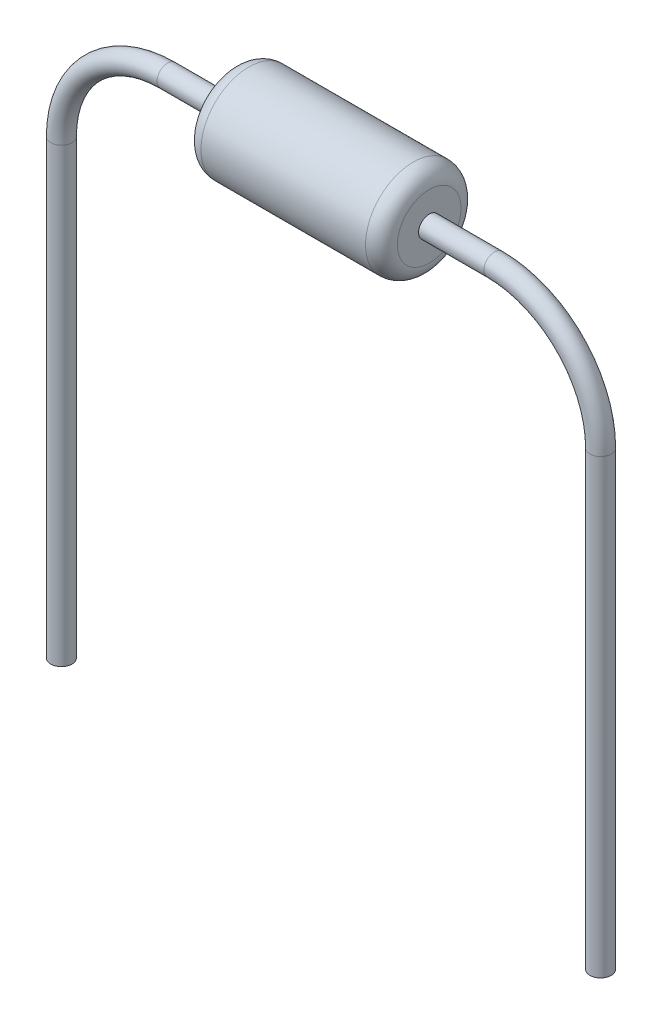
ISO-10303-21;
HEADER;
FILE_DESCRIPTION(('STEP AP214'),'2;1');
FILE_NAME('part.step','',(''),(''),'','','');
FILE_SCHEMA(('AUTOMOTIVE_DESIGN { 1 0 10303 214 1 1 1 1 }'));
ENDSEC;
DATA;
#1=APPLICATION_CONTEXT('core data for automotive mechanical design processes');
#2=APPLICATION_PROTOCOL_DEFINITION('international standard','automotive_design',2000,#1);
#3=PRODUCT_CONTEXT('',#1,'mechanical');
#4=PRODUCT('Part','Part','',(#3));
#5=PRODUCT_RELATED_PRODUCT_CATEGORY('part','',(#4));
#6=PRODUCT_DEFINITION_FORMATION('','',#4);
#7=PRODUCT_DEFINITION_CONTEXT('part definition',#1,'design');
#8=PRODUCT_DEFINITION('design','',#6,#7);
#9=PRODUCT_DEFINITION_SHAPE('','',#8);
#10=(LENGTH_UNIT() NAMED_UNIT(*) SI_UNIT(.MILLI.,.METRE.));
#11=(NAMED_UNIT(*) PLANE_ANGLE_UNIT() SI_UNIT($,.RADIAN.));
#12=(NAMED_UNIT(*) SI_UNIT($,.STERADIAN.) SOLID_ANGLE_UNIT());
#13=UNCERTAINTY_MEASURE_WITH_UNIT(LENGTH_MEASURE(1.E-05),#10,'distance_accuracy_value','');
#14=(GEOMETRIC_REPRESENTATION_CONTEXT(3) GLOBAL_UNCERTAINTY_ASSIGNED_CONTEXT((#13)) GLOBAL_UNIT_ASSIGNED_CONTEXT((#10,
#11,#12)) REPRESENTATION_CONTEXT('',''));
#15=CARTESIAN_POINT('',(0.,0.,0.));
#16=DIRECTION('',(0.,0.,1.));
#17=DIRECTION('',(1.,0.,0.));
#18=AXIS2_PLACEMENT_3D('',#15,#16,#17);
#19=CARTESIAN_POINT('',(-1.55,0.,0.));
#20=DIRECTION('',(1.,0.,0.));
#21=DIRECTION('',(0.,1.,0.));
#22=AXIS2_PLACEMENT_3D('',#19,#20,#21);
#23=TOROIDAL_SURFACE('',#22,0.7,0.1);
#24=CARTESIAN_POINT('',(-1.65,0.,0.));
#25=DIRECTION('',(1.,0.,0.));
#26=DIRECTION('',(0.,1.,0.));
#27=AXIS2_PLACEMENT_3D('',#24,#25,#26);
#28=CIRCLE('',#27,0.699999999999999);
#29=CARTESIAN_POINT('',(-1.65,0.699999999999999,0.));
#30=VERTEX_POINT('',#29);
#31=EDGE_CURVE('E11',#30,#30,#28,.T.);
#32=ORIENTED_EDGE('',*,*,#31,.T.);
#33=EDGE_LOOP('',(#32));
#34=FACE_BOUND('',#33,.T.);
#35=CARTESIAN_POINT('',(-1.55,0.,0.));
#36=DIRECTION('',(1.,0.,0.));
#37=DIRECTION('',(0.,1.,0.));
#38=AXIS2_PLACEMENT_3D('',#35,#36,#37);
#39=CIRCLE('',#38,0.8);
#40=CARTESIAN_POINT('',(-1.55,0.8,0.));
#41=VERTEX_POINT('',#40);
#42=EDGE_CURVE('E68',#41,#41,#39,.T.);
#43=ORIENTED_EDGE('',*,*,#42,.F.);
#44=EDGE_LOOP('',(#43));
#45=FACE_BOUND('',#44,.T.);
#46=ADVANCED_FACE('F46',(#34,#45),#23,.T.);
#47=CARTESIAN_POINT('',(-1.65,0.42,0.));
#48=DIRECTION('',(-1.,0.,0.));
#49=DIRECTION('',(0.,-1.,0.));
#50=AXIS2_PLACEMENT_3D('',#47,#48,#49);
#51=PLANE('',#50);
#52=CARTESIAN_POINT('',(-1.65,0.,0.));
#53=DIRECTION('',(1.,0.,0.));
#54=DIRECTION('',(0.,1.,0.));
#55=AXIS2_PLACEMENT_3D('',#52,#53,#54);
#56=CIRCLE('',#55,0.42);
#57=CARTESIAN_POINT('',(-1.65,0.42,0.));
#58=VERTEX_POINT('',#57);
#59=EDGE_CURVE('E52',#58,#58,#56,.T.);
#60=ORIENTED_EDGE('',*,*,#59,.T.);
#61=EDGE_LOOP('',(#60));
#62=FACE_BOUND('',#61,.T.);
#63=ORIENTED_EDGE('',*,*,#31,.F.);
#64=EDGE_LOOP('',(#63));
#65=FACE_BOUND('',#64,.T.);
#66=ADVANCED_FACE('F76',(#62,#65),#51,.T.);
#67=CARTESIAN_POINT('',(-0.95,0.,0.));
#68=DIRECTION('',(1.,0.,0.));
#69=DIRECTION('',(0.,1.,0.));
#70=AXIS2_PLACEMENT_3D('',#67,#68,#69);
#71=CYLINDRICAL_SURFACE('',#70,0.42);
#72=CARTESIAN_POINT('',(-0.95,0.,0.));
#73=DIRECTION('',(1.,0.,0.));
#74=DIRECTION('',(0.,1.,0.));
#75=AXIS2_PLACEMENT_3D('',#72,#73,#74);
#76=CIRCLE('',#75,0.42);
#77=CARTESIAN_POINT('',(-0.95,0.42,0.));
#78=VERTEX_POINT('',#77);
#79=EDGE_CURVE('E56',#78,#78,#76,.T.);
#80=ORIENTED_EDGE('',*,*,#79,.T.);
#81=EDGE_LOOP('',(#80));
#82=FACE_BOUND('',#81,.T.);
#83=ORIENTED_EDGE('',*,*,#59,.F.);
#84=EDGE_LOOP('',(#83));
#85=FACE_BOUND('',#84,.T.);
#86=ADVANCED_FACE('F80',(#82,#85),#71,.F.);
#87=CARTESIAN_POINT('',(-0.95,0.42,0.));
#88=DIRECTION('',(1.,0.,0.));
#89=DIRECTION('',(0.,1.,0.));
#90=AXIS2_PLACEMENT_3D('',#87,#88,#89);
#91=PLANE('',#90);
#92=CARTESIAN_POINT('',(-0.95,0.,0.));
#93=DIRECTION('',(1.,0.,0.));
#94=DIRECTION('',(0.,1.,0.));
#95=AXIS2_PLACEMENT_3D('',#92,#93,#94);
#96=CIRCLE('',#95,0.75);
#97=CARTESIAN_POINT('',(-0.95,0.75,0.));
#98=VERTEX_POINT('',#97);
#99=EDGE_CURVE('E60',#98,#98,#96,.T.);
#100=ORIENTED_EDGE('',*,*,#99,.T.);
#101=EDGE_LOOP('',(#100));
#102=FACE_BOUND('',#101,.T.);
#103=ORIENTED_EDGE('',*,*,#79,.F.);
#104=EDGE_LOOP('',(#103));
#105=FACE_BOUND('',#104,.T.);
#106=ADVANCED_FACE('F84',(#102,#105),#91,.T.);
#107=CARTESIAN_POINT('',(-1.,0.,0.));
#108=DIRECTION('',(1.,0.,0.));
#109=DIRECTION('',(0.,1.,0.));
#110=AXIS2_PLACEMENT_3D('',#107,#108,#109);
#111=TOROIDAL_SURFACE('',#110,0.75,0.05);
#112=CARTESIAN_POINT('',(-1.,0.,0.));
#113=DIRECTION('',(1.,0.,0.));
#114=DIRECTION('',(0.,1.,0.));
#115=AXIS2_PLACEMENT_3D('',#112,#113,#114);
#116=CIRCLE('',#115,0.8);
#117=CARTESIAN_POINT('',(-1.,0.8,0.));
#118=VERTEX_POINT('',#117);
#119=EDGE_CURVE('E65',#118,#118,#116,.T.);
#120=ORIENTED_EDGE('',*,*,#119,.T.);
#121=EDGE_LOOP('',(#120));
#122=FACE_BOUND('',#121,.T.);
#123=ORIENTED_EDGE('',*,*,#99,.F.);
#124=EDGE_LOOP('',(#123));
#125=FACE_BOUND('',#124,.T.);
#126=ADVANCED_FACE('F91',(#122,#125),#111,.T.);
#127=CARTESIAN_POINT('',(-0.95,0.,0.));
#128=DIRECTION('',(1.,0.,0.));
#129=DIRECTION('',(0.,1.,0.));
#130=AXIS2_PLACEMENT_3D('',#127,#128,#129);
#131=CYLINDRICAL_SURFACE('',#130,0.8);
#132=ORIENTED_EDGE('',*,*,#42,.T.);
#133=EDGE_LOOP('',(#132));
#134=FACE_BOUND('',#133,.T.);
#135=ORIENTED_EDGE('',*,*,#119,.F.);
#136=EDGE_LOOP('',(#135));
#137=FACE_BOUND('',#136,.T.);
#138=ADVANCED_FACE('F72',(#134,#137),#131,.T.);
#139=CLOSED_SHELL('',(#46,#66,#86,#106,#126,#138));
#140=MANIFOLD_SOLID_BREP('B2',#139);
#141=CARTESIAN_POINT('',(5.08,-10.5081985585135,0.));
#142=DIRECTION('',(0.,-1.,0.));
#143=DIRECTION('',(0.,0.,-1.));
#144=AXIS2_PLACEMENT_3D('',#141,#142,#143);
#145=PLANE('',#144);
#146=CARTESIAN_POINT('',(5.08,-10.5081985585135,0.));
#147=DIRECTION('',(0.,-1.,0.));
#148=DIRECTION('',(0.,0.,-1.));
#149=AXIS2_PLACEMENT_3D('',#146,#147,#148);
#150=CIRCLE('',#149,0.2);
#151=CARTESIAN_POINT('',(5.08,-10.5081985585135,-0.2));
#152=VERTEX_POINT('',#151);
#153=EDGE_CURVE('E168',#152,#152,#150,.T.);
#154=ORIENTED_EDGE('',*,*,#153,.T.);
#155=EDGE_LOOP('',(#154));
#156=FACE_BOUND('',#155,.T.);
#157=ADVANCED_FACE('F146',(#156),#145,.T.);
#158=CARTESIAN_POINT('',(-5.08,-10.5081985585135,0.));
#159=DIRECTION('',(0.,1.,0.));
#160=DIRECTION('',(0.,0.,-1.));
#161=AXIS2_PLACEMENT_3D('',#158,#159,#160);
#162=PLANE('',#161);
#163=CARTESIAN_POINT('',(-5.08,-10.5081985585135,0.));
#164=DIRECTION('',(0.,1.,0.));
#165=DIRECTION('',(0.,0.,-1.));
#166=AXIS2_PLACEMENT_3D('',#163,#164,#165);
#167=CIRCLE('',#166,0.2);
#168=CARTESIAN_POINT('',(-5.08,-10.5081985585135,-0.2));
#169=VERTEX_POINT('',#168);
#170=EDGE_CURVE('E45',#169,#169,#167,.T.);
#171=ORIENTED_EDGE('',*,*,#170,.F.);
#172=EDGE_LOOP('',(#171));
#173=FACE_BOUND('',#172,.T.);
#174=ADVANCED_FACE('F176',(#173),#162,.F.);
#175=CARTESIAN_POINT('',(5.08,-10.5081985585135,0.));
#176=DIRECTION('',(0.,1.,0.));
#177=DIRECTION('',(-1.,0.,0.));
#178=AXIS2_PLACEMENT_3D('',#175,#176,#177);
#179=CYLINDRICAL_SURFACE('',#178,0.2);
#180=CARTESIAN_POINT('',(5.08,-2.00000000000001,0.));
#181=DIRECTION('',(0.,-1.,0.));
#182=DIRECTION('',(0.,0.,-1.));
#183=AXIS2_PLACEMENT_3D('',#180,#181,#182);
#184=CIRCLE('',#183,0.2);
#185=CARTESIAN_POINT('',(5.28,-2.00000000000001,0.));
#186=VERTEX_POINT('',#185);
#187=EDGE_CURVE('E165',#186,#186,#184,.T.);
#188=ORIENTED_EDGE('',*,*,#187,.T.);
#189=EDGE_LOOP('',(#188));
#190=FACE_BOUND('',#189,.T.);
#191=ORIENTED_EDGE('',*,*,#153,.F.);
#192=EDGE_LOOP('',(#191));
#193=FACE_BOUND('',#192,.T.);
#194=ADVANCED_FACE('F173',(#190,#193),#179,.T.);
#195=CARTESIAN_POINT('',(3.08,-2.,0.));
#196=DIRECTION('',(0.,0.,1.));
#197=DIRECTION('',(1.,0.,0.));
#198=AXIS2_PLACEMENT_3D('',#195,#196,#197);
#199=TOROIDAL_SURFACE('',#198,2.,0.2);
#200=CARTESIAN_POINT('',(3.07999999999999,0.,0.));
#201=DIRECTION('',(1.,0.,0.));
#202=DIRECTION('',(0.,0.,-1.));
#203=AXIS2_PLACEMENT_3D('',#200,#201,#202);
#204=CIRCLE('',#203,0.2);
#205=CARTESIAN_POINT('',(3.07999999999999,0.200000000000001,0.));
#206=VERTEX_POINT('',#205);
#207=EDGE_CURVE('E160',#206,#206,#204,.T.);
#208=CARTESIAN_POINT('',(3.08,-2.,0.));
#209=DIRECTION('',(0.,0.,1.));
#210=DIRECTION('',(1.,0.,0.));
#211=AXIS2_PLACEMENT_3D('',#208,#209,#210);
#212=CIRCLE('',#211,2.2);
#213=EDGE_CURVE('',#186,#206,#212,.T.);
#214=ORIENTED_EDGE('',*,*,#187,.F.);
#215=ORIENTED_EDGE('',*,*,#207,.T.);
#216=ORIENTED_EDGE('',*,*,#213,.T.);
#217=ORIENTED_EDGE('',*,*,#213,.F.);
#218=EDGE_LOOP('',(#214,#216,#215,#217));
#219=FACE_BOUND('',#218,.T.);
#220=ADVANCED_FACE('F175',(#219),#199,.T.);
#221=CARTESIAN_POINT('',(3.07999999999999,0.,0.));
#222=DIRECTION('',(-1.,0.,0.));
#223=DIRECTION('',(0.,-1.,0.));
#224=AXIS2_PLACEMENT_3D('',#221,#222,#223);
#225=CYLINDRICAL_SURFACE('',#224,0.2);
#226=CARTESIAN_POINT('',(-3.07999999999999,0.,0.));
#227=DIRECTION('',(1.,0.,0.));
#228=DIRECTION('',(0.,0.,-1.));
#229=AXIS2_PLACEMENT_3D('',#226,#227,#228);
#230=CIRCLE('',#229,0.2);
#231=CARTESIAN_POINT('',(-3.07999999999998,0.2,0.));
#232=VERTEX_POINT('',#231);
#233=EDGE_CURVE('E156',#232,#232,#230,.T.);
#234=ORIENTED_EDGE('',*,*,#233,.T.);
#235=EDGE_LOOP('',(#234));
#236=FACE_BOUND('',#235,.T.);
#237=ORIENTED_EDGE('',*,*,#207,.F.);
#238=EDGE_LOOP('',(#237));
#239=FACE_BOUND('',#238,.T.);
#240=ADVANCED_FACE('F183',(#236,#239),#225,.T.);
#241=CARTESIAN_POINT('',(-3.08,-2.,0.));
#242=DIRECTION('',(0.,0.,1.));
#243=DIRECTION('',(1.,0.,0.));
#244=AXIS2_PLACEMENT_3D('',#241,#242,#243);
#245=TOROIDAL_SURFACE('',#244,2.,0.2);
#246=CARTESIAN_POINT('',(-5.08,-2.00000000000001,0.));
#247=DIRECTION('',(0.,1.,0.));
#248=DIRECTION('',(0.,0.,-1.));
#249=AXIS2_PLACEMENT_3D('',#246,#247,#248);
#250=CIRCLE('',#249,0.2);
#251=CARTESIAN_POINT('',(-5.28,-2.00000000000002,0.));
#252=VERTEX_POINT('',#251);
#253=EDGE_CURVE('E152',#252,#252,#250,.T.);
#254=CARTESIAN_POINT('',(-3.08,-2.,0.));
#255=DIRECTION('',(0.,0.,1.));
#256=DIRECTION('',(1.,0.,0.));
#257=AXIS2_PLACEMENT_3D('',#254,#255,#256);
#258=CIRCLE('',#257,2.2);
#259=EDGE_CURVE('',#232,#252,#258,.T.);
#260=ORIENTED_EDGE('',*,*,#233,.F.);
#261=ORIENTED_EDGE('',*,*,#253,.T.);
#262=ORIENTED_EDGE('',*,*,#259,.T.);
#263=ORIENTED_EDGE('',*,*,#259,.F.);
#264=EDGE_LOOP('',(#260,#262,#261,#263));
#265=FACE_BOUND('',#264,.T.);
#266=ADVANCED_FACE('F189',(#265),#245,.T.);
#267=CARTESIAN_POINT('',(-5.08,-2.00000000000001,0.));
#268=DIRECTION('',(0.,-1.,0.));
#269=DIRECTION('',(1.,0.,0.));
#270=AXIS2_PLACEMENT_3D('',#267,#268,#269);
#271=CYLINDRICAL_SURFACE('',#270,0.2);
#272=ORIENTED_EDGE('',*,*,#170,.T.);
#273=EDGE_LOOP('',(#272));
#274=FACE_BOUND('',#273,.T.);
#275=ORIENTED_EDGE('',*,*,#253,.F.);
#276=EDGE_LOOP('',(#275));
#277=FACE_BOUND('',#276,.T.);
#278=ADVANCED_FACE('F187',(#274,#277),#271,.T.);
#279=CLOSED_SHELL('',(#157,#174,#194,#220,#240,#266,#278));
#280=MANIFOLD_SOLID_BREP('B6',#279);
#281=CARTESIAN_POINT('',(1.85,0.,0.));
#282=DIRECTION('',(1.,0.,0.));
#283=DIRECTION('',(0.,0.,-1.));
#284=AXIS2_PLACEMENT_3D('',#281,#282,#283);
#285=PLANE('',#284);
#286=CARTESIAN_POINT('',(1.85,0.,0.));
#287=DIRECTION('',(1.,0.,0.));
#288=DIRECTION('',(0.,0.,-1.));
#289=AXIS2_PLACEMENT_3D('',#286,#287,#288);
#290=CIRCLE('',#289,0.6);
#291=CARTESIAN_POINT('',(1.85,0.,-0.6));
#292=VERTEX_POINT('',#291);
#293=EDGE_CURVE('E145',#292,#292,#290,.T.);
#294=ORIENTED_EDGE('',*,*,#293,.T.);
#295=EDGE_LOOP('',(#294));
#296=FACE_BOUND('',#295,.T.);
#297=CARTESIAN_POINT('',(1.85,0.,0.));
#298=DIRECTION('',(1.,0.,0.));
#299=DIRECTION('',(0.,0.,-1.));
#300=AXIS2_PLACEMENT_3D('',#297,#298,#299);
#301=CIRCLE('',#300,0.2);
#302=CARTESIAN_POINT('',(1.85,0.,-0.2));
#303=VERTEX_POINT('',#302);
#304=EDGE_CURVE('E274',#303,#303,#301,.T.);
#305=ORIENTED_EDGE('',*,*,#304,.F.);
#306=EDGE_LOOP('',(#305));
#307=FACE_BOUND('',#306,.T.);
#308=ADVANCED_FACE('F254',(#296,#307),#285,.T.);
#309=CARTESIAN_POINT('',(-1.85,0.,0.));
#310=DIRECTION('',(1.,0.,0.));
#311=DIRECTION('',(0.,0.,-1.));
#312=AXIS2_PLACEMENT_3D('',#309,#310,#311);
#313=PLANE('',#312);
#314=CARTESIAN_POINT('',(-1.85,0.,0.));
#315=DIRECTION('',(1.,0.,0.));
#316=DIRECTION('',(0.,0.,-1.));
#317=AXIS2_PLACEMENT_3D('',#314,#315,#316);
#318=CIRCLE('',#317,0.6);
#319=CARTESIAN_POINT('',(-1.85,0.,-0.6));
#320=VERTEX_POINT('',#319);
#321=EDGE_CURVE('E261',#320,#320,#318,.F.);
#322=ORIENTED_EDGE('',*,*,#321,.T.);
#323=EDGE_LOOP('',(#322));
#324=FACE_BOUND('',#323,.T.);
#325=CARTESIAN_POINT('',(-1.85,0.,0.));
#326=DIRECTION('',(1.,0.,0.));
#327=DIRECTION('',(0.,0.,-1.));
#328=AXIS2_PLACEMENT_3D('',#325,#326,#327);
#329=CIRCLE('',#328,0.2);
#330=CARTESIAN_POINT('',(-1.85,0.,-0.2));
#331=VERTEX_POINT('',#330);
#332=EDGE_CURVE('E275',#331,#331,#329,.T.);
#333=ORIENTED_EDGE('',*,*,#332,.T.);
#334=EDGE_LOOP('',(#333));
#335=FACE_BOUND('',#334,.T.);
#336=ADVANCED_FACE('F285',(#324,#335),#313,.F.);
#337=CARTESIAN_POINT('',(1.85,0.,0.));
#338=DIRECTION('',(-1.,0.,0.));
#339=DIRECTION('',(0.,0.,1.));
#340=AXIS2_PLACEMENT_3D('',#337,#338,#339);
#341=CYLINDRICAL_SURFACE('',#340,0.9);
#342=CARTESIAN_POINT('',(-1.55,0.,0.));
#343=DIRECTION('',(1.,0.,0.));
#344=DIRECTION('',(0.,0.,-1.));
#345=AXIS2_PLACEMENT_3D('',#342,#343,#344);
#346=CIRCLE('',#345,0.9);
#347=CARTESIAN_POINT('',(-1.55,0.,-0.9));
#348=VERTEX_POINT('',#347);
#349=EDGE_CURVE('E265',#348,#348,#346,.T.);
#350=ORIENTED_EDGE('',*,*,#349,.T.);
#351=EDGE_LOOP('',(#350));
#352=FACE_BOUND('',#351,.T.);
#353=CARTESIAN_POINT('',(1.55,0.,0.));
#354=DIRECTION('',(1.,0.,0.));
#355=DIRECTION('',(0.,0.,-1.));
#356=AXIS2_PLACEMENT_3D('',#353,#354,#355);
#357=CIRCLE('',#356,0.9);
#358=CARTESIAN_POINT('',(1.55,0.,-0.9));
#359=VERTEX_POINT('',#358);
#360=EDGE_CURVE('E269',#359,#359,#357,.F.);
#361=ORIENTED_EDGE('',*,*,#360,.T.);
#362=EDGE_LOOP('',(#361));
#363=FACE_BOUND('',#362,.T.);
#364=ADVANCED_FACE('F290',(#352,#363),#341,.T.);
#365=CARTESIAN_POINT('',(1.85,0.,0.));
#366=DIRECTION('',(-1.,0.,0.));
#367=DIRECTION('',(0.,0.,1.));
#368=AXIS2_PLACEMENT_3D('',#365,#366,#367);
#369=CYLINDRICAL_SURFACE('',#368,0.2);
#370=ORIENTED_EDGE('',*,*,#304,.T.);
#371=EDGE_LOOP('',(#370));
#372=FACE_BOUND('',#371,.T.);
#373=ORIENTED_EDGE('',*,*,#332,.F.);
#374=EDGE_LOOP('',(#373));
#375=FACE_BOUND('',#374,.T.);
#376=ADVANCED_FACE('F281',(#372,#375),#369,.F.);
#377=CARTESIAN_POINT('',(-1.55,0.,0.));
#378=DIRECTION('',(1.,0.,0.));
#379=DIRECTION('',(0.,0.,-1.));
#380=AXIS2_PLACEMENT_3D('',#377,#378,#379);
#381=TOROIDAL_SURFACE('',#380,0.6,0.3);
#382=ORIENTED_EDGE('',*,*,#321,.F.);
#383=EDGE_LOOP('',(#382));
#384=FACE_BOUND('',#383,.T.);
#385=ORIENTED_EDGE('',*,*,#349,.F.);
#386=EDGE_LOOP('',(#385));
#387=FACE_BOUND('',#386,.T.);
#388=ADVANCED_FACE('F296',(#384,#387),#381,.T.);
#389=CARTESIAN_POINT('',(1.55,0.,0.));
#390=DIRECTION('',(1.,0.,0.));
#391=DIRECTION('',(0.,0.,-1.));
#392=AXIS2_PLACEMENT_3D('',#389,#390,#391);
#393=TOROIDAL_SURFACE('',#392,0.6,0.3);
#394=ORIENTED_EDGE('',*,*,#360,.F.);
#395=EDGE_LOOP('',(#394));
#396=FACE_BOUND('',#395,.T.);
#397=ORIENTED_EDGE('',*,*,#293,.F.);
#398=EDGE_LOOP('',(#397));
#399=FACE_BOUND('',#398,.T.);
#400=ADVANCED_FACE('F256',(#396,#399),#393,.T.);
#401=CLOSED_SHELL('',(#308,#336,#364,#376,#388,#400));
#402=MANIFOLD_SOLID_BREP('B40',#401);
#403=CARTESIAN_POINT('',(1.75,0.,0.));
#404=DIRECTION('',(-1.,0.,0.));
#405=DIRECTION('',(0.,0.,1.));
#406=AXIS2_PLACEMENT_3D('',#403,#404,#405);
#407=CYLINDRICAL_SURFACE('',#406,0.4);
#408=CARTESIAN_POINT('',(-0.11180339887499,0.,0.));
#409=DIRECTION('',(-1.,0.,0.));
#410=DIRECTION('',(0.,0.,1.));
#411=AXIS2_PLACEMENT_3D('',#408,#409,#410);
#412=CIRCLE('',#411,0.4);
#413=CARTESIAN_POINT('',(-0.11180339887499,0.,0.4));
#414=VERTEX_POINT('',#413);
#415=EDGE_CURVE('E253',#414,#414,#412,.T.);
#416=ORIENTED_EDGE('',*,*,#415,.T.);
#417=EDGE_LOOP('',(#416));
#418=FACE_BOUND('',#417,.T.);
#419=CARTESIAN_POINT('',(-1.65,0.,0.));
#420=DIRECTION('',(1.,0.,0.));
#421=DIRECTION('',(0.,0.,-1.));
#422=AXIS2_PLACEMENT_3D('',#419,#420,#421);
#423=CIRCLE('',#422,0.4);
#424=CARTESIAN_POINT('',(-1.65,0.,-0.4));
#425=VERTEX_POINT('',#424);
#426=EDGE_CURVE('E371',#425,#425,#423,.T.);
#427=ORIENTED_EDGE('',*,*,#426,.T.);
#428=EDGE_LOOP('',(#427));
#429=FACE_BOUND('',#428,.T.);
#430=ADVANCED_FACE('F345',(#418,#429),#407,.T.);
#431=CARTESIAN_POINT('',(0.11180339887499,0.,0.));
#432=DIRECTION('',(1.,0.,0.));
#433=DIRECTION('',(0.,0.,-1.));
#434=AXIS2_PLACEMENT_3D('',#431,#432,#433);
#435=CIRCLE('',#434,0.4);
#436=CARTESIAN_POINT('',(0.11180339887499,0.,-0.4));
#437=VERTEX_POINT('',#436);
#438=EDGE_CURVE('E352',#437,#437,#435,.T.);
#439=ORIENTED_EDGE('',*,*,#438,.T.);
#440=EDGE_LOOP('',(#439));
#441=FACE_BOUND('',#440,.T.);
#442=CARTESIAN_POINT('',(1.65,0.,0.));
#443=DIRECTION('',(1.,0.,0.));
#444=DIRECTION('',(0.,0.,-1.));
#445=AXIS2_PLACEMENT_3D('',#442,#443,#444);
#446=CIRCLE('',#445,0.4);
#447=CARTESIAN_POINT('',(1.65,0.,-0.4));
#448=VERTEX_POINT('',#447);
#449=EDGE_CURVE('E374',#448,#448,#446,.F.);
#450=ORIENTED_EDGE('',*,*,#449,.T.);
#451=EDGE_LOOP('',(#450));
#452=FACE_BOUND('',#451,.T.);
#453=ADVANCED_FACE('F390',(#441,#452),#407,.T.);
#454=CARTESIAN_POINT('',(1.75,0.,0.));
#455=DIRECTION('',(1.,0.,0.));
#456=DIRECTION('',(0.,0.,-1.));
#457=AXIS2_PLACEMENT_3D('',#454,#455,#456);
#458=PLANE('',#457);
#459=CARTESIAN_POINT('',(1.75,0.,0.));
#460=DIRECTION('',(1.,0.,0.));
#461=DIRECTION('',(0.,0.,-1.));
#462=AXIS2_PLACEMENT_3D('',#459,#460,#461);
#463=CIRCLE('',#462,0.3);
#464=CARTESIAN_POINT('',(1.75,0.,-0.3));
#465=VERTEX_POINT('',#464);
#466=EDGE_CURVE('E365',#465,#465,#463,.T.);
#467=ORIENTED_EDGE('',*,*,#466,.T.);
#468=EDGE_LOOP('',(#467));
#469=FACE_BOUND('',#468,.T.);
#470=CARTESIAN_POINT('',(1.75,0.,0.));
#471=DIRECTION('',(1.,0.,0.));
#472=DIRECTION('',(0.,0.,-1.));
#473=AXIS2_PLACEMENT_3D('',#470,#471,#472);
#474=CIRCLE('',#473,0.2);
#475=CARTESIAN_POINT('',(1.75,0.,-0.2));
#476=VERTEX_POINT('',#475);
#477=EDGE_CURVE('E377',#476,#476,#474,.T.);
#478=ORIENTED_EDGE('',*,*,#477,.F.);
#479=EDGE_LOOP('',(#478));
#480=FACE_BOUND('',#479,.T.);
#481=ADVANCED_FACE('F387',(#469,#480),#458,.T.);
#482=CARTESIAN_POINT('',(-1.75,0.,0.));
#483=DIRECTION('',(1.,0.,0.));
#484=DIRECTION('',(0.,0.,-1.));
#485=AXIS2_PLACEMENT_3D('',#482,#483,#484);
#486=PLANE('',#485);
#487=CARTESIAN_POINT('',(-1.75,0.,0.));
#488=DIRECTION('',(1.,0.,0.));
#489=DIRECTION('',(0.,0.,-1.));
#490=AXIS2_PLACEMENT_3D('',#487,#488,#489);
#491=CIRCLE('',#490,0.3);
#492=CARTESIAN_POINT('',(-1.75,0.,-0.3));
#493=VERTEX_POINT('',#492);
#494=EDGE_CURVE('E368',#493,#493,#491,.F.);
#495=ORIENTED_EDGE('',*,*,#494,.T.);
#496=EDGE_LOOP('',(#495));
#497=FACE_BOUND('',#496,.T.);
#498=CARTESIAN_POINT('',(-1.75,0.,0.));
#499=DIRECTION('',(1.,0.,0.));
#500=DIRECTION('',(0.,0.,-1.));
#501=AXIS2_PLACEMENT_3D('',#498,#499,#500);
#502=CIRCLE('',#501,0.2);
#503=CARTESIAN_POINT('',(-1.75,0.,-0.2));
#504=VERTEX_POINT('',#503);
#505=EDGE_CURVE('E378',#504,#504,#502,.T.);
#506=ORIENTED_EDGE('',*,*,#505,.T.);
#507=EDGE_LOOP('',(#506));
#508=FACE_BOUND('',#507,.T.);
#509=ADVANCED_FACE('F389',(#497,#508),#486,.F.);
#510=CARTESIAN_POINT('',(1.75,0.,0.));
#511=DIRECTION('',(-1.,0.,0.));
#512=DIRECTION('',(0.,0.,1.));
#513=AXIS2_PLACEMENT_3D('',#510,#511,#512);
#514=CYLINDRICAL_SURFACE('',#513,0.2);
#515=ORIENTED_EDGE('',*,*,#477,.T.);
#516=EDGE_LOOP('',(#515));
#517=FACE_BOUND('',#516,.T.);
#518=ORIENTED_EDGE('',*,*,#505,.F.);
#519=EDGE_LOOP('',(#518));
#520=FACE_BOUND('',#519,.T.);
#521=ADVANCED_FACE('F384',(#517,#520),#514,.F.);
#522=CARTESIAN_POINT('',(-1.65,0.,0.));
#523=DIRECTION('',(1.,0.,0.));
#524=DIRECTION('',(0.,0.,-1.));
#525=AXIS2_PLACEMENT_3D('',#522,#523,#524);
#526=TOROIDAL_SURFACE('',#525,0.3,0.1);
#527=ORIENTED_EDGE('',*,*,#494,.F.);
#528=EDGE_LOOP('',(#527));
#529=FACE_BOUND('',#528,.T.);
#530=ORIENTED_EDGE('',*,*,#426,.F.);
#531=EDGE_LOOP('',(#530));
#532=FACE_BOUND('',#531,.T.);
#533=ADVANCED_FACE('F406',(#529,#532),#526,.T.);
#534=CARTESIAN_POINT('',(1.65,0.,0.));
#535=DIRECTION('',(1.,0.,0.));
#536=DIRECTION('',(0.,0.,-1.));
#537=AXIS2_PLACEMENT_3D('',#534,#535,#536);
#538=TOROIDAL_SURFACE('',#537,0.3,0.1);
#539=ORIENTED_EDGE('',*,*,#449,.F.);
#540=EDGE_LOOP('',(#539));
#541=FACE_BOUND('',#540,.T.);
#542=ORIENTED_EDGE('',*,*,#466,.F.);
#543=EDGE_LOOP('',(#542));
#544=FACE_BOUND('',#543,.T.);
#545=ADVANCED_FACE('F409',(#541,#544),#538,.T.);
#546=CARTESIAN_POINT('',(0.,0.,0.));
#547=DIRECTION('',(-1.,0.,0.));
#548=DIRECTION('',(0.,0.,1.));
#549=AXIS2_PLACEMENT_3D('',#546,#547,#548);
#550=TOROIDAL_SURFACE('',#549,0.4,0.05);
#551=CARTESIAN_POINT('',(0.0372677996249964,0.,0.));
#552=DIRECTION('',(-1.,0.,0.));
#553=DIRECTION('',(0.,0.,1.));
#554=AXIS2_PLACEMENT_3D('',#551,#552,#553);
#555=CIRCLE('',#554,0.366666666666667);
#556=CARTESIAN_POINT('',(0.0372677996249964,0.,0.366666666666667));
#557=VERTEX_POINT('',#556);
#558=EDGE_CURVE('E356',#557,#557,#555,.T.);
#559=ORIENTED_EDGE('',*,*,#558,.T.);
#560=EDGE_LOOP('',(#559));
#561=FACE_BOUND('',#560,.T.);
#562=CARTESIAN_POINT('',(-0.0372677996249964,0.,0.));
#563=DIRECTION('',(1.,0.,0.));
#564=DIRECTION('',(0.,0.,-1.));
#565=AXIS2_PLACEMENT_3D('',#562,#563,#564);
#566=CIRCLE('',#565,0.366666666666667);
#567=CARTESIAN_POINT('',(-0.0372677996249964,0.,-0.366666666666667));
#568=VERTEX_POINT('',#567);
#569=EDGE_CURVE('E360',#568,#568,#566,.T.);
#570=ORIENTED_EDGE('',*,*,#569,.T.);
#571=EDGE_LOOP('',(#570));
#572=FACE_BOUND('',#571,.T.);
#573=ADVANCED_FACE('F412',(#561,#572),#550,.F.);
#574=CARTESIAN_POINT('',(0.11180339887499,0.,0.));
#575=DIRECTION('',(1.,0.,0.));
#576=DIRECTION('',(0.,0.,-1.));
#577=AXIS2_PLACEMENT_3D('',#574,#575,#576);
#578=TOROIDAL_SURFACE('',#577,0.3,0.1);
#579=ORIENTED_EDGE('',*,*,#438,.F.);
#580=EDGE_LOOP('',(#579));
#581=FACE_BOUND('',#580,.T.);
#582=ORIENTED_EDGE('',*,*,#558,.F.);
#583=EDGE_LOOP('',(#582));
#584=FACE_BOUND('',#583,.T.);
#585=ADVANCED_FACE('F414',(#581,#584),#578,.T.);
#586=CARTESIAN_POINT('',(-0.11180339887499,0.,0.));
#587=DIRECTION('',(-1.,0.,0.));
#588=DIRECTION('',(0.,0.,1.));
#589=AXIS2_PLACEMENT_3D('',#586,#587,#588);
#590=TOROIDAL_SURFACE('',#589,0.3,0.1);
#591=ORIENTED_EDGE('',*,*,#415,.F.);
#592=EDGE_LOOP('',(#591));
#593=FACE_BOUND('',#592,.T.);
#594=ORIENTED_EDGE('',*,*,#569,.F.);
#595=EDGE_LOOP('',(#594));
#596=FACE_BOUND('',#595,.T.);
#597=ADVANCED_FACE('F347',(#593,#596),#590,.T.);
#598=CLOSED_SHELL('',(#430,#453,#481,#509,#521,#533,#545,#573,#585,#597));
#599=MANIFOLD_SOLID_BREP('B140',#598);
#600=ADVANCED_BREP_SHAPE_REPRESENTATION('',(#18,#140,#280,#402,#599),#14);
#601=SHAPE_DEFINITION_REPRESENTATION(#9,#600);
ENDSEC;
END-ISO-10303-21;
